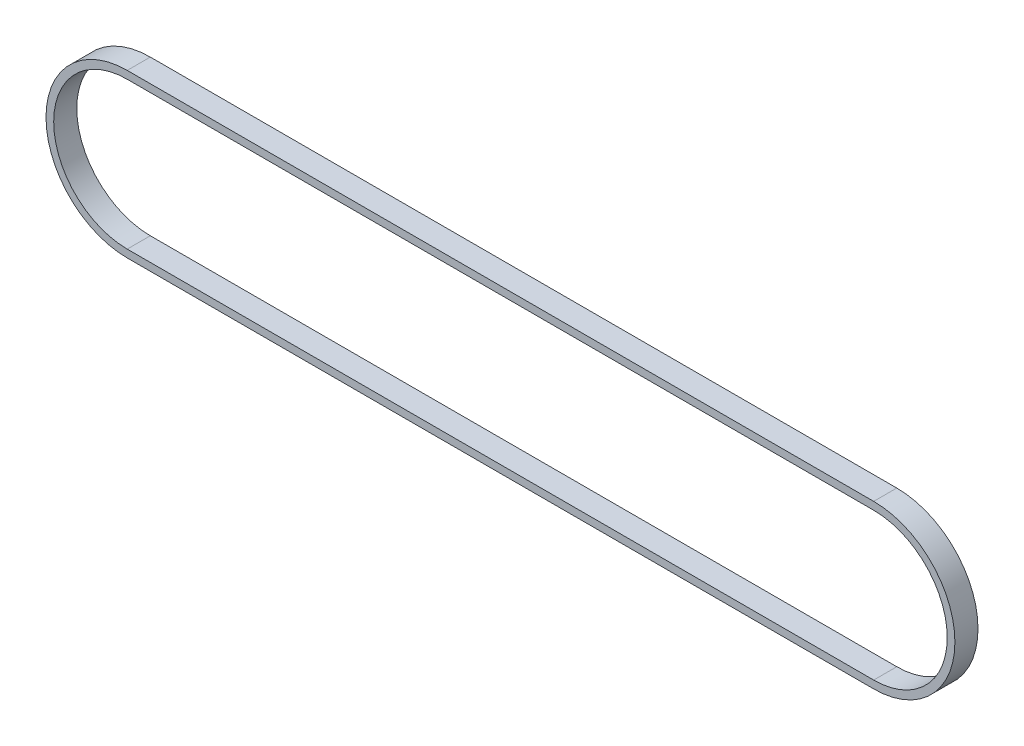
ISO-10303-21;
HEADER;
FILE_DESCRIPTION(('STEP AP214'),'2;1');
FILE_NAME('part.step','',(''),(''),'','','');
FILE_SCHEMA(('AUTOMOTIVE_DESIGN { 1 0 10303 214 1 1 1 1 }'));
ENDSEC;
DATA;
#1=APPLICATION_CONTEXT('core data for automotive mechanical design processes');
#2=APPLICATION_PROTOCOL_DEFINITION('international standard','automotive_design',2000,#1);
#3=PRODUCT_CONTEXT('',#1,'mechanical');
#4=PRODUCT('Part','Part','',(#3));
#5=PRODUCT_RELATED_PRODUCT_CATEGORY('part','',(#4));
#6=PRODUCT_DEFINITION_FORMATION('','',#4);
#7=PRODUCT_DEFINITION_CONTEXT('part definition',#1,'design');
#8=PRODUCT_DEFINITION('design','',#6,#7);
#9=PRODUCT_DEFINITION_SHAPE('','',#8);
#10=(LENGTH_UNIT() NAMED_UNIT(*) SI_UNIT(.MILLI.,.METRE.));
#11=(NAMED_UNIT(*) PLANE_ANGLE_UNIT() SI_UNIT($,.RADIAN.));
#12=(NAMED_UNIT(*) SI_UNIT($,.STERADIAN.) SOLID_ANGLE_UNIT());
#13=UNCERTAINTY_MEASURE_WITH_UNIT(LENGTH_MEASURE(1.E-05),#10,'distance_accuracy_value','');
#14=(GEOMETRIC_REPRESENTATION_CONTEXT(3) GLOBAL_UNCERTAINTY_ASSIGNED_CONTEXT((#13)) GLOBAL_UNIT_ASSIGNED_CONTEXT((#10,
#11,#12)) REPRESENTATION_CONTEXT('',''));
#15=CARTESIAN_POINT('',(0.,0.,0.));
#16=DIRECTION('',(0.,0.,1.));
#17=DIRECTION('',(1.,0.,0.));
#18=AXIS2_PLACEMENT_3D('',#15,#16,#17);
#19=CARTESIAN_POINT('',(0.,0.,6.));
#20=DIRECTION('',(0.,0.,1.));
#21=DIRECTION('',(1.,0.,0.));
#22=AXIS2_PLACEMENT_3D('',#19,#20,#21);
#23=PLANE('',#22);
#24=CARTESIAN_POINT('',(0.,0.,6.));
#25=DIRECTION('',(0.,0.,1.));
#26=DIRECTION('',(1.,0.,0.));
#27=AXIS2_PLACEMENT_3D('',#24,#25,#26);
#28=CIRCLE('',#27,21.11);
#29=CARTESIAN_POINT('',(0.,21.11,6.));
#30=VERTEX_POINT('',#29);
#31=CARTESIAN_POINT('',(0.,-21.11,6.));
#32=VERTEX_POINT('',#31);
#33=EDGE_CURVE('E153',#30,#32,#28,.T.);
#34=ORIENTED_EDGE('',*,*,#33,.T.);
#35=DIRECTION('',(1.,0.,0.));
#36=VECTOR('',#35,1.);
#37=CARTESIAN_POINT('',(194.,-21.11,6.));
#38=LINE('',#37,#36);
#39=CARTESIAN_POINT('',(194.,-21.11,6.));
#40=VERTEX_POINT('',#39);
#41=EDGE_CURVE('E157',#32,#40,#38,.T.);
#42=ORIENTED_EDGE('',*,*,#41,.T.);
#43=CARTESIAN_POINT('',(194.,0.,6.));
#44=DIRECTION('',(0.,0.,1.));
#45=DIRECTION('',(1.,0.,0.));
#46=AXIS2_PLACEMENT_3D('',#43,#44,#45);
#47=CIRCLE('',#46,21.11);
#48=CARTESIAN_POINT('',(194.,21.11,6.));
#49=VERTEX_POINT('',#48);
#50=EDGE_CURVE('E161',#40,#49,#47,.T.);
#51=ORIENTED_EDGE('',*,*,#50,.T.);
#52=DIRECTION('',(-1.,0.,0.));
#53=VECTOR('',#52,1.);
#54=CARTESIAN_POINT('',(0.,21.11,6.));
#55=LINE('',#54,#53);
#56=EDGE_CURVE('E164',#49,#30,#55,.T.);
#57=ORIENTED_EDGE('',*,*,#56,.T.);
#58=EDGE_LOOP('',(#34,#42,#51,#57));
#59=FACE_BOUND('',#58,.T.);
#60=DIRECTION('',(1.,0.,0.));
#61=VECTOR('',#60,1.);
#62=CARTESIAN_POINT('',(194.,-19.11,6.));
#63=LINE('',#62,#61);
#64=CARTESIAN_POINT('',(0.,-19.11,6.));
#65=VERTEX_POINT('',#64);
#66=CARTESIAN_POINT('',(194.,-19.11,6.));
#67=VERTEX_POINT('',#66);
#68=EDGE_CURVE('E114',#65,#67,#63,.T.);
#69=ORIENTED_EDGE('',*,*,#68,.F.);
#70=CARTESIAN_POINT('',(0.,0.,6.));
#71=DIRECTION('',(0.,0.,1.));
#72=DIRECTION('',(1.,0.,0.));
#73=AXIS2_PLACEMENT_3D('',#70,#71,#72);
#74=CIRCLE('',#73,19.11);
#75=CARTESIAN_POINT('',(0.,19.11,6.));
#76=VERTEX_POINT('',#75);
#77=EDGE_CURVE('E105',#76,#65,#74,.T.);
#78=ORIENTED_EDGE('',*,*,#77,.F.);
#79=DIRECTION('',(-1.,0.,0.));
#80=VECTOR('',#79,1.);
#81=CARTESIAN_POINT('',(0.,19.11,6.));
#82=LINE('',#81,#80);
#83=CARTESIAN_POINT('',(194.,19.11,6.));
#84=VERTEX_POINT('',#83);
#85=EDGE_CURVE('E131',#84,#76,#82,.T.);
#86=ORIENTED_EDGE('',*,*,#85,.F.);
#87=CARTESIAN_POINT('',(194.,0.,6.));
#88=DIRECTION('',(0.,0.,1.));
#89=DIRECTION('',(1.,0.,0.));
#90=AXIS2_PLACEMENT_3D('',#87,#88,#89);
#91=CIRCLE('',#90,19.11);
#92=EDGE_CURVE('E127',#67,#84,#91,.T.);
#93=ORIENTED_EDGE('',*,*,#92,.F.);
#94=EDGE_LOOP('',(#69,#78,#86,#93));
#95=FACE_BOUND('',#94,.T.);
#96=ADVANCED_FACE('F39',(#59,#95),#23,.T.);
#97=CARTESIAN_POINT('',(0.,0.,0.));
#98=DIRECTION('',(0.,0.,1.));
#99=DIRECTION('',(1.,0.,0.));
#100=AXIS2_PLACEMENT_3D('',#97,#98,#99);
#101=PLANE('',#100);
#102=CARTESIAN_POINT('',(0.,0.,0.));
#103=DIRECTION('',(0.,0.,1.));
#104=DIRECTION('',(1.,0.,0.));
#105=AXIS2_PLACEMENT_3D('',#102,#103,#104);
#106=CIRCLE('',#105,21.11);
#107=CARTESIAN_POINT('',(0.,21.11,0.));
#108=VERTEX_POINT('',#107);
#109=CARTESIAN_POINT('',(0.,-21.11,0.));
#110=VERTEX_POINT('',#109);
#111=EDGE_CURVE('E123',#108,#110,#106,.T.);
#112=ORIENTED_EDGE('',*,*,#111,.F.);
#113=DIRECTION('',(-1.,0.,0.));
#114=VECTOR('',#113,1.);
#115=CARTESIAN_POINT('',(0.,21.11,0.));
#116=LINE('',#115,#114);
#117=CARTESIAN_POINT('',(194.,21.11,0.));
#118=VERTEX_POINT('',#117);
#119=EDGE_CURVE('E158',#118,#108,#116,.T.);
#120=ORIENTED_EDGE('',*,*,#119,.F.);
#121=CARTESIAN_POINT('',(194.,0.,0.));
#122=DIRECTION('',(0.,0.,1.));
#123=DIRECTION('',(1.,0.,0.));
#124=AXIS2_PLACEMENT_3D('',#121,#122,#123);
#125=CIRCLE('',#124,21.11);
#126=CARTESIAN_POINT('',(194.,-21.11,0.));
#127=VERTEX_POINT('',#126);
#128=EDGE_CURVE('E174',#127,#118,#125,.T.);
#129=ORIENTED_EDGE('',*,*,#128,.F.);
#130=DIRECTION('',(1.,0.,0.));
#131=VECTOR('',#130,1.);
#132=CARTESIAN_POINT('',(194.,-21.11,0.));
#133=LINE('',#132,#131);
#134=EDGE_CURVE('E171',#110,#127,#133,.T.);
#135=ORIENTED_EDGE('',*,*,#134,.F.);
#136=EDGE_LOOP('',(#112,#120,#129,#135));
#137=FACE_BOUND('',#136,.T.);
#138=CARTESIAN_POINT('',(0.,0.,0.));
#139=DIRECTION('',(0.,0.,1.));
#140=DIRECTION('',(1.,0.,0.));
#141=AXIS2_PLACEMENT_3D('',#138,#139,#140);
#142=CIRCLE('',#141,19.11);
#143=CARTESIAN_POINT('',(0.,19.11,0.));
#144=VERTEX_POINT('',#143);
#145=CARTESIAN_POINT('',(0.,-19.11,0.));
#146=VERTEX_POINT('',#145);
#147=EDGE_CURVE('E63',#144,#146,#142,.T.);
#148=ORIENTED_EDGE('',*,*,#147,.T.);
#149=DIRECTION('',(1.,0.,0.));
#150=VECTOR('',#149,1.);
#151=CARTESIAN_POINT('',(194.,-19.11,0.));
#152=LINE('',#151,#150);
#153=CARTESIAN_POINT('',(194.,-19.11,0.));
#154=VERTEX_POINT('',#153);
#155=EDGE_CURVE('E121',#146,#154,#152,.T.);
#156=ORIENTED_EDGE('',*,*,#155,.T.);
#157=CARTESIAN_POINT('',(194.,0.,0.));
#158=DIRECTION('',(0.,0.,1.));
#159=DIRECTION('',(1.,0.,0.));
#160=AXIS2_PLACEMENT_3D('',#157,#158,#159);
#161=CIRCLE('',#160,19.11);
#162=CARTESIAN_POINT('',(194.,19.11,0.));
#163=VERTEX_POINT('',#162);
#164=EDGE_CURVE('E140',#154,#163,#161,.T.);
#165=ORIENTED_EDGE('',*,*,#164,.T.);
#166=DIRECTION('',(-1.,0.,0.));
#167=VECTOR('',#166,1.);
#168=CARTESIAN_POINT('',(0.,19.11,0.));
#169=LINE('',#168,#167);
#170=EDGE_CURVE('E115',#163,#144,#169,.T.);
#171=ORIENTED_EDGE('',*,*,#170,.T.);
#172=EDGE_LOOP('',(#148,#156,#165,#171));
#173=FACE_BOUND('',#172,.T.);
#174=ADVANCED_FACE('F197',(#137,#173),#101,.F.);
#175=CARTESIAN_POINT('',(0.,0.,6.));
#176=DIRECTION('',(0.,0.,-1.));
#177=DIRECTION('',(-1.,0.,0.));
#178=AXIS2_PLACEMENT_3D('',#175,#176,#177);
#179=CYLINDRICAL_SURFACE('',#178,21.11);
#180=ORIENTED_EDGE('',*,*,#111,.T.);
#181=DIRECTION('',(0.,0.,-1.));
#182=VECTOR('',#181,1.);
#183=CARTESIAN_POINT('',(0.,-21.11,6.));
#184=LINE('',#183,#182);
#185=EDGE_CURVE('E11',#32,#110,#184,.T.);
#186=ORIENTED_EDGE('',*,*,#185,.F.);
#187=ORIENTED_EDGE('',*,*,#33,.F.);
#188=DIRECTION('',(0.,0.,-1.));
#189=VECTOR('',#188,1.);
#190=CARTESIAN_POINT('',(0.,21.11,6.));
#191=LINE('',#190,#189);
#192=EDGE_CURVE('E167',#30,#108,#191,.T.);
#193=ORIENTED_EDGE('',*,*,#192,.T.);
#194=EDGE_LOOP('',(#180,#186,#187,#193));
#195=FACE_BOUND('',#194,.T.);
#196=ADVANCED_FACE('F41',(#195),#179,.T.);
#197=CARTESIAN_POINT('',(194.,-21.11,6.));
#198=DIRECTION('',(0.,1.,0.));
#199=DIRECTION('',(-1.,0.,0.));
#200=AXIS2_PLACEMENT_3D('',#197,#198,#199);
#201=PLANE('',#200);
#202=ORIENTED_EDGE('',*,*,#134,.T.);
#203=DIRECTION('',(0.,0.,-1.));
#204=VECTOR('',#203,1.);
#205=CARTESIAN_POINT('',(194.,-21.11,6.));
#206=LINE('',#205,#204);
#207=EDGE_CURVE('E48',#40,#127,#206,.T.);
#208=ORIENTED_EDGE('',*,*,#207,.F.);
#209=ORIENTED_EDGE('',*,*,#41,.F.);
#210=ORIENTED_EDGE('',*,*,#185,.T.);
#211=EDGE_LOOP('',(#202,#208,#209,#210));
#212=FACE_BOUND('',#211,.T.);
#213=ADVANCED_FACE('F207',(#212),#201,.F.);
#214=CARTESIAN_POINT('',(194.,0.,6.));
#215=DIRECTION('',(0.,0.,-1.));
#216=DIRECTION('',(-1.,0.,0.));
#217=AXIS2_PLACEMENT_3D('',#214,#215,#216);
#218=CYLINDRICAL_SURFACE('',#217,21.11);
#219=ORIENTED_EDGE('',*,*,#128,.T.);
#220=DIRECTION('',(0.,0.,-1.));
#221=VECTOR('',#220,1.);
#222=CARTESIAN_POINT('',(194.,21.11,6.));
#223=LINE('',#222,#221);
#224=EDGE_CURVE('E182',#49,#118,#223,.T.);
#225=ORIENTED_EDGE('',*,*,#224,.F.);
#226=ORIENTED_EDGE('',*,*,#50,.F.);
#227=ORIENTED_EDGE('',*,*,#207,.T.);
#228=EDGE_LOOP('',(#219,#225,#226,#227));
#229=FACE_BOUND('',#228,.T.);
#230=ADVANCED_FACE('F191',(#229),#218,.T.);
#231=CARTESIAN_POINT('',(0.,21.11,6.));
#232=DIRECTION('',(0.,-1.,0.));
#233=DIRECTION('',(0.,0.,-1.));
#234=AXIS2_PLACEMENT_3D('',#231,#232,#233);
#235=PLANE('',#234);
#236=ORIENTED_EDGE('',*,*,#119,.T.);
#237=ORIENTED_EDGE('',*,*,#192,.F.);
#238=ORIENTED_EDGE('',*,*,#56,.F.);
#239=ORIENTED_EDGE('',*,*,#224,.T.);
#240=EDGE_LOOP('',(#236,#237,#238,#239));
#241=FACE_BOUND('',#240,.T.);
#242=ADVANCED_FACE('F201',(#241),#235,.F.);
#243=CARTESIAN_POINT('',(0.,0.,6.));
#244=DIRECTION('',(0.,0.,-1.));
#245=DIRECTION('',(-1.,0.,0.));
#246=AXIS2_PLACEMENT_3D('',#243,#244,#245);
#247=CYLINDRICAL_SURFACE('',#246,19.11);
#248=ORIENTED_EDGE('',*,*,#147,.F.);
#249=DIRECTION('',(0.,0.,-1.));
#250=VECTOR('',#249,1.);
#251=CARTESIAN_POINT('',(0.,19.11,6.));
#252=LINE('',#251,#250);
#253=EDGE_CURVE('E109',#76,#144,#252,.T.);
#254=ORIENTED_EDGE('',*,*,#253,.F.);
#255=ORIENTED_EDGE('',*,*,#77,.T.);
#256=DIRECTION('',(0.,0.,-1.));
#257=VECTOR('',#256,1.);
#258=CARTESIAN_POINT('',(0.,-19.11,6.));
#259=LINE('',#258,#257);
#260=EDGE_CURVE('E108',#65,#146,#259,.T.);
#261=ORIENTED_EDGE('',*,*,#260,.T.);
#262=EDGE_LOOP('',(#248,#254,#255,#261));
#263=FACE_BOUND('',#262,.T.);
#264=ADVANCED_FACE('F107',(#263),#247,.F.);
#265=CARTESIAN_POINT('',(194.,-19.11,6.));
#266=DIRECTION('',(0.,1.,0.));
#267=DIRECTION('',(0.,0.,1.));
#268=AXIS2_PLACEMENT_3D('',#265,#266,#267);
#269=PLANE('',#268);
#270=ORIENTED_EDGE('',*,*,#155,.F.);
#271=ORIENTED_EDGE('',*,*,#260,.F.);
#272=ORIENTED_EDGE('',*,*,#68,.T.);
#273=DIRECTION('',(0.,0.,-1.));
#274=VECTOR('',#273,1.);
#275=CARTESIAN_POINT('',(194.,-19.11,6.));
#276=LINE('',#275,#274);
#277=EDGE_CURVE('E124',#67,#154,#276,.T.);
#278=ORIENTED_EDGE('',*,*,#277,.T.);
#279=EDGE_LOOP('',(#270,#271,#272,#278));
#280=FACE_BOUND('',#279,.T.);
#281=ADVANCED_FACE('F118',(#280),#269,.T.);
#282=CARTESIAN_POINT('',(194.,0.,6.));
#283=DIRECTION('',(0.,0.,-1.));
#284=DIRECTION('',(-1.,0.,0.));
#285=AXIS2_PLACEMENT_3D('',#282,#283,#284);
#286=CYLINDRICAL_SURFACE('',#285,19.11);
#287=ORIENTED_EDGE('',*,*,#164,.F.);
#288=ORIENTED_EDGE('',*,*,#277,.F.);
#289=ORIENTED_EDGE('',*,*,#92,.T.);
#290=DIRECTION('',(0.,0.,-1.));
#291=VECTOR('',#290,1.);
#292=CARTESIAN_POINT('',(194.,19.11,6.));
#293=LINE('',#292,#291);
#294=EDGE_CURVE('E55',#84,#163,#293,.T.);
#295=ORIENTED_EDGE('',*,*,#294,.T.);
#296=EDGE_LOOP('',(#287,#288,#289,#295));
#297=FACE_BOUND('',#296,.T.);
#298=ADVANCED_FACE('F230',(#297),#286,.F.);
#299=CARTESIAN_POINT('',(0.,19.11,6.));
#300=DIRECTION('',(0.,-1.,0.));
#301=DIRECTION('',(0.,0.,-1.));
#302=AXIS2_PLACEMENT_3D('',#299,#300,#301);
#303=PLANE('',#302);
#304=ORIENTED_EDGE('',*,*,#170,.F.);
#305=ORIENTED_EDGE('',*,*,#294,.F.);
#306=ORIENTED_EDGE('',*,*,#85,.T.);
#307=ORIENTED_EDGE('',*,*,#253,.T.);
#308=EDGE_LOOP('',(#304,#305,#306,#307));
#309=FACE_BOUND('',#308,.T.);
#310=ADVANCED_FACE('F234',(#309),#303,.T.);
#311=CLOSED_SHELL('',(#96,#174,#196,#213,#230,#242,#264,#281,#298,#310));
#312=MANIFOLD_SOLID_BREP('B2',#311);
#313=ADVANCED_BREP_SHAPE_REPRESENTATION('',(#18,#312),#14);
#314=SHAPE_DEFINITION_REPRESENTATION(#9,#313);
ENDSEC;
END-ISO-10303-21;
